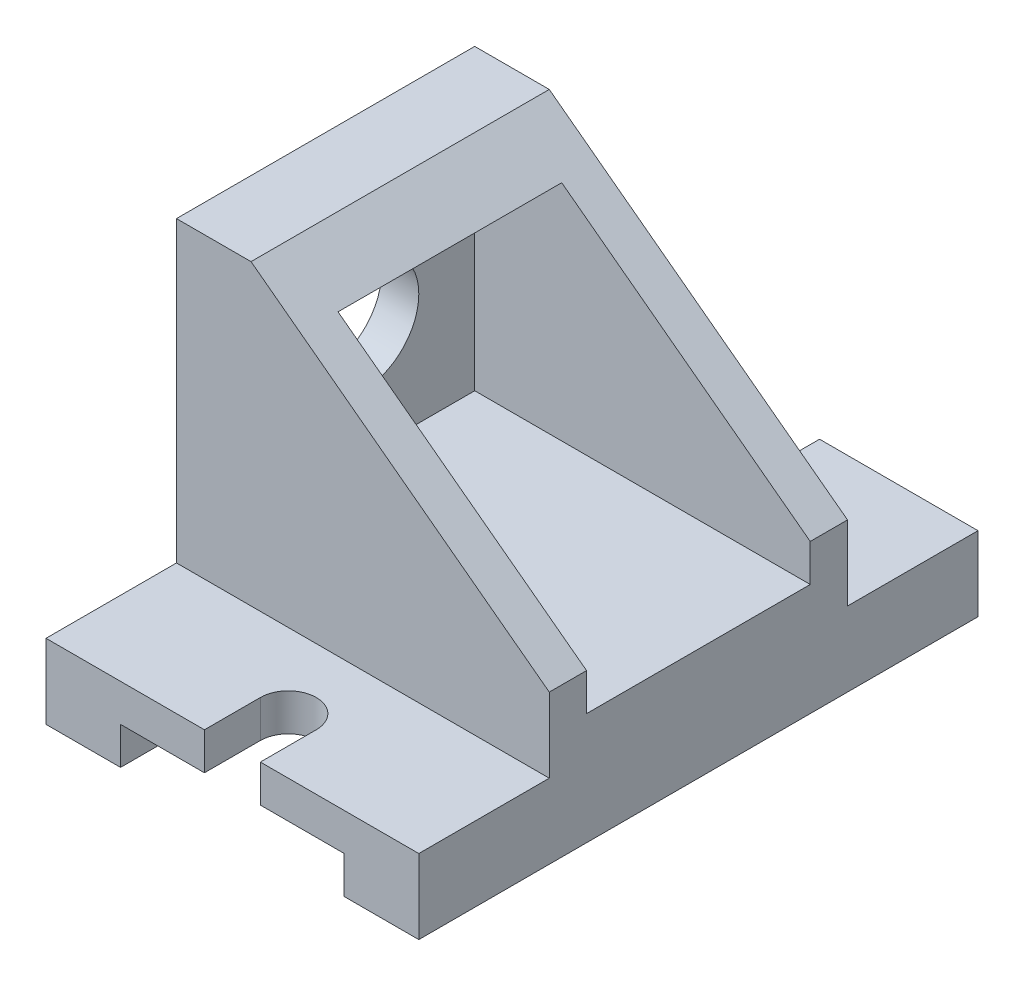
ISO-10303-21;
HEADER;
FILE_DESCRIPTION(('STEP AP214'),'2;1');
FILE_NAME('part.step','',(''),(''),'','','');
FILE_SCHEMA(('AUTOMOTIVE_DESIGN { 1 0 10303 214 1 1 1 1 }'));
ENDSEC;
DATA;
#1=APPLICATION_CONTEXT('core data for automotive mechanical design processes');
#2=APPLICATION_PROTOCOL_DEFINITION('international standard','automotive_design',2000,#1);
#3=PRODUCT_CONTEXT('',#1,'mechanical');
#4=PRODUCT('Part','Part','',(#3));
#5=PRODUCT_RELATED_PRODUCT_CATEGORY('part','',(#4));
#6=PRODUCT_DEFINITION_FORMATION('','',#4);
#7=PRODUCT_DEFINITION_CONTEXT('part definition',#1,'design');
#8=PRODUCT_DEFINITION('design','',#6,#7);
#9=PRODUCT_DEFINITION_SHAPE('','',#8);
#10=(LENGTH_UNIT() NAMED_UNIT(*) SI_UNIT(.MILLI.,.METRE.));
#11=(NAMED_UNIT(*) PLANE_ANGLE_UNIT() SI_UNIT($,.RADIAN.));
#12=(NAMED_UNIT(*) SI_UNIT($,.STERADIAN.) SOLID_ANGLE_UNIT());
#13=UNCERTAINTY_MEASURE_WITH_UNIT(LENGTH_MEASURE(1.E-05),#10,'distance_accuracy_value','');
#14=(GEOMETRIC_REPRESENTATION_CONTEXT(3) GLOBAL_UNCERTAINTY_ASSIGNED_CONTEXT((#13)) GLOBAL_UNIT_ASSIGNED_CONTEXT((#10,
#11,#12)) REPRESENTATION_CONTEXT('',''));
#15=CARTESIAN_POINT('',(0.,0.,0.));
#16=DIRECTION('',(0.,0.,1.));
#17=DIRECTION('',(1.,0.,0.));
#18=AXIS2_PLACEMENT_3D('',#15,#16,#17);
#19=CARTESIAN_POINT('',(0.,0.,-150.));
#20=DIRECTION('',(0.,-1.,0.));
#21=DIRECTION('',(0.,0.,-1.));
#22=AXIS2_PLACEMENT_3D('',#19,#20,#21);
#23=PLANE('',#22);
#24=DIRECTION('',(0.,0.,1.));
#25=VECTOR('',#24,1.);
#26=CARTESIAN_POINT('',(80.,0.,-178.));
#27=LINE('',#26,#25);
#28=CARTESIAN_POINT('',(80.,0.,-150.));
#29=VERTEX_POINT('',#28);
#30=CARTESIAN_POINT('',(80.,0.,0.));
#31=VERTEX_POINT('',#30);
#32=EDGE_CURVE('E292',#29,#31,#27,.T.);
#33=ORIENTED_EDGE('',*,*,#32,.F.);
#34=DIRECTION('',(1.,0.,0.));
#35=VECTOR('',#34,1.);
#36=CARTESIAN_POINT('',(0.,0.,-150.));
#37=LINE('',#36,#35);
#38=CARTESIAN_POINT('',(100.,0.,-150.));
#39=VERTEX_POINT('',#38);
#40=EDGE_CURVE('E434',#29,#39,#37,.T.);
#41=ORIENTED_EDGE('',*,*,#40,.T.);
#42=DIRECTION('',(0.,0.,1.));
#43=VECTOR('',#42,1.);
#44=CARTESIAN_POINT('',(100.,0.,-150.));
#45=LINE('',#44,#43);
#46=CARTESIAN_POINT('',(100.,0.,0.));
#47=VERTEX_POINT('',#46);
#48=EDGE_CURVE('E460',#39,#47,#45,.T.);
#49=ORIENTED_EDGE('',*,*,#48,.T.);
#50=DIRECTION('',(1.,0.,0.));
#51=VECTOR('',#50,1.);
#52=CARTESIAN_POINT('',(0.,0.,0.));
#53=LINE('',#52,#51);
#54=EDGE_CURVE('E447',#31,#47,#53,.T.);
#55=ORIENTED_EDGE('',*,*,#54,.F.);
#56=EDGE_LOOP('',(#33,#41,#49,#55));
#57=FACE_BOUND('',#56,.T.);
#58=ADVANCED_FACE('F43',(#57),#23,.T.);
#59=CARTESIAN_POINT('',(0.,0.,-150.));
#60=DIRECTION('',(0.,0.,-1.));
#61=DIRECTION('',(-1.,0.,0.));
#62=AXIS2_PLACEMENT_3D('',#59,#60,#61);
#63=PLANE('',#62);
#64=DIRECTION('',(0.,1.,0.));
#65=VECTOR('',#64,1.);
#66=CARTESIAN_POINT('',(20.,0.,-150.));
#67=LINE('',#66,#65);
#68=CARTESIAN_POINT('',(20.,0.,-150.));
#69=VERTEX_POINT('',#68);
#70=CARTESIAN_POINT('',(20.,9.99999999999999,-150.));
#71=VERTEX_POINT('',#70);
#72=EDGE_CURVE('E327',#69,#71,#67,.T.);
#73=ORIENTED_EDGE('',*,*,#72,.F.);
#74=CARTESIAN_POINT('',(0.,0.,-150.));
#75=VERTEX_POINT('',#74);
#76=EDGE_CURVE('E436',#75,#69,#37,.T.);
#77=ORIENTED_EDGE('',*,*,#76,.F.);
#78=DIRECTION('',(0.,-1.,0.));
#79=VECTOR('',#78,1.);
#80=CARTESIAN_POINT('',(0.,0.,-150.));
#81=LINE('',#80,#79);
#82=CARTESIAN_POINT('',(0.,20.,-150.));
#83=VERTEX_POINT('',#82);
#84=EDGE_CURVE('E431',#83,#75,#81,.T.);
#85=ORIENTED_EDGE('',*,*,#84,.F.);
#86=DIRECTION('',(-1.,0.,0.));
#87=VECTOR('',#86,1.);
#88=CARTESIAN_POINT('',(0.,20.,-150.));
#89=LINE('',#88,#87);
#90=CARTESIAN_POINT('',(42.5,20.,-150.));
#91=VERTEX_POINT('',#90);
#92=EDGE_CURVE('E403',#91,#83,#89,.T.);
#93=ORIENTED_EDGE('',*,*,#92,.F.);
#94=DIRECTION('',(0.,1.,0.));
#95=VECTOR('',#94,1.);
#96=CARTESIAN_POINT('',(42.5,-3.,-150.));
#97=LINE('',#96,#95);
#98=CARTESIAN_POINT('',(42.5,10.,-150.));
#99=VERTEX_POINT('',#98);
#100=EDGE_CURVE('E344',#99,#91,#97,.T.);
#101=ORIENTED_EDGE('',*,*,#100,.F.);
#102=DIRECTION('',(1.,0.,0.));
#103=VECTOR('',#102,1.);
#104=CARTESIAN_POINT('',(0.,9.99999999999999,-150.));
#105=LINE('',#104,#103);
#106=EDGE_CURVE('E324',#71,#99,#105,.T.);
#107=ORIENTED_EDGE('',*,*,#106,.F.);
#108=EDGE_LOOP('',(#73,#77,#85,#93,#101,#107));
#109=FACE_BOUND('',#108,.T.);
#110=ADVANCED_FACE('F575',(#109),#63,.T.);
#111=CARTESIAN_POINT('',(0.,0.,0.));
#112=DIRECTION('',(0.,0.,-1.));
#113=DIRECTION('',(-1.,0.,0.));
#114=AXIS2_PLACEMENT_3D('',#111,#112,#113);
#115=PLANE('',#114);
#116=DIRECTION('',(-1.,0.,0.));
#117=VECTOR('',#116,1.);
#118=CARTESIAN_POINT('',(80.,10.,0.));
#119=LINE('',#118,#117);
#120=CARTESIAN_POINT('',(80.,10.,0.));
#121=VERTEX_POINT('',#120);
#122=CARTESIAN_POINT('',(57.5,10.,0.));
#123=VERTEX_POINT('',#122);
#124=EDGE_CURVE('E285',#121,#123,#119,.T.);
#125=ORIENTED_EDGE('',*,*,#124,.F.);
#126=DIRECTION('',(0.,1.,0.));
#127=VECTOR('',#126,1.);
#128=CARTESIAN_POINT('',(80.,10.,0.));
#129=LINE('',#128,#127);
#130=EDGE_CURVE('E277',#31,#121,#129,.T.);
#131=ORIENTED_EDGE('',*,*,#130,.F.);
#132=ORIENTED_EDGE('',*,*,#54,.T.);
#133=DIRECTION('',(0.,1.,0.));
#134=VECTOR('',#133,1.);
#135=CARTESIAN_POINT('',(100.,0.,0.));
#136=LINE('',#135,#134);
#137=CARTESIAN_POINT('',(100.,20.,0.));
#138=VERTEX_POINT('',#137);
#139=EDGE_CURVE('E435',#47,#138,#136,.T.);
#140=ORIENTED_EDGE('',*,*,#139,.T.);
#141=DIRECTION('',(1.,0.,0.));
#142=VECTOR('',#141,1.);
#143=CARTESIAN_POINT('',(0.,20.,0.));
#144=LINE('',#143,#142);
#145=CARTESIAN_POINT('',(57.5,20.,0.));
#146=VERTEX_POINT('',#145);
#147=EDGE_CURVE('E368',#146,#138,#144,.T.);
#148=ORIENTED_EDGE('',*,*,#147,.F.);
#149=DIRECTION('',(0.,1.,0.));
#150=VECTOR('',#149,1.);
#151=CARTESIAN_POINT('',(57.5,-3.,0.));
#152=LINE('',#151,#150);
#153=EDGE_CURVE('E335',#123,#146,#152,.T.);
#154=ORIENTED_EDGE('',*,*,#153,.F.);
#155=EDGE_LOOP('',(#125,#131,#132,#140,#148,#154));
#156=FACE_BOUND('',#155,.T.);
#157=ADVANCED_FACE('F555',(#156),#115,.F.);
#158=DIRECTION('',(0.,0.,1.));
#159=VECTOR('',#158,1.);
#160=CARTESIAN_POINT('',(20.,0.,-178.));
#161=LINE('',#160,#159);
#162=CARTESIAN_POINT('',(20.,0.,0.));
#163=VERTEX_POINT('',#162);
#164=EDGE_CURVE('E296',#69,#163,#161,.T.);
#165=ORIENTED_EDGE('',*,*,#164,.T.);
#166=CARTESIAN_POINT('',(0.,0.,0.));
#167=VERTEX_POINT('',#166);
#168=EDGE_CURVE('E448',#167,#163,#53,.T.);
#169=ORIENTED_EDGE('',*,*,#168,.F.);
#170=DIRECTION('',(0.,0.,1.));
#171=VECTOR('',#170,1.);
#172=CARTESIAN_POINT('',(0.,0.,-150.));
#173=LINE('',#172,#171);
#174=EDGE_CURVE('E444',#75,#167,#173,.T.);
#175=ORIENTED_EDGE('',*,*,#174,.F.);
#176=ORIENTED_EDGE('',*,*,#76,.T.);
#177=EDGE_LOOP('',(#165,#169,#175,#176));
#178=FACE_BOUND('',#177,.T.);
#179=ADVANCED_FACE('F581',(#178),#23,.T.);
#180=CARTESIAN_POINT('',(0.,0.,-150.));
#181=DIRECTION('',(-1.,0.,0.));
#182=DIRECTION('',(0.,0.,1.));
#183=AXIS2_PLACEMENT_3D('',#180,#181,#182);
#184=PLANE('',#183);
#185=CARTESIAN_POINT('',(0.,60.,-75.));
#186=DIRECTION('',(-1.,0.,0.));
#187=DIRECTION('',(0.,0.,1.));
#188=AXIS2_PLACEMENT_3D('',#185,#186,#187);
#189=CIRCLE('',#188,15.);
#190=CARTESIAN_POINT('',(0.,60.,-60.));
#191=VERTEX_POINT('',#190);
#192=EDGE_CURVE('E250',#191,#191,#189,.T.);
#193=ORIENTED_EDGE('',*,*,#192,.F.);
#194=EDGE_LOOP('',(#193));
#195=FACE_BOUND('',#194,.T.);
#196=DIRECTION('',(0.,0.,1.));
#197=VECTOR('',#196,1.);
#198=CARTESIAN_POINT('',(0.,20.,0.));
#199=LINE('',#198,#197);
#200=CARTESIAN_POINT('',(0.,20.,-35.));
#201=VERTEX_POINT('',#200);
#202=CARTESIAN_POINT('',(0.,20.,0.));
#203=VERTEX_POINT('',#202);
#204=EDGE_CURVE('E379',#201,#203,#199,.T.);
#205=ORIENTED_EDGE('',*,*,#204,.F.);
#206=DIRECTION('',(0.,1.,0.));
#207=VECTOR('',#206,1.);
#208=CARTESIAN_POINT('',(0.,20.,-35.));
#209=LINE('',#208,#207);
#210=CARTESIAN_POINT('',(0.,100.,-35.));
#211=VERTEX_POINT('',#210);
#212=EDGE_CURVE('E386',#201,#211,#209,.T.);
#213=ORIENTED_EDGE('',*,*,#212,.T.);
#214=DIRECTION('',(0.,0.,1.));
#215=VECTOR('',#214,1.);
#216=CARTESIAN_POINT('',(0.,100.,-150.));
#217=LINE('',#216,#215);
#218=CARTESIAN_POINT('',(0.,100.,-115.));
#219=VERTEX_POINT('',#218);
#220=EDGE_CURVE('E455',#219,#211,#217,.T.);
#221=ORIENTED_EDGE('',*,*,#220,.F.);
#222=DIRECTION('',(0.,1.,0.));
#223=VECTOR('',#222,1.);
#224=CARTESIAN_POINT('',(0.,20.,-115.));
#225=LINE('',#224,#223);
#226=CARTESIAN_POINT('',(0.,20.,-115.));
#227=VERTEX_POINT('',#226);
#228=EDGE_CURVE('E422',#227,#219,#225,.T.);
#229=ORIENTED_EDGE('',*,*,#228,.F.);
#230=DIRECTION('',(0.,0.,1.));
#231=VECTOR('',#230,1.);
#232=CARTESIAN_POINT('',(0.,20.,0.));
#233=LINE('',#232,#231);
#234=EDGE_CURVE('E406',#83,#227,#233,.T.);
#235=ORIENTED_EDGE('',*,*,#234,.F.);
#236=ORIENTED_EDGE('',*,*,#84,.T.);
#237=ORIENTED_EDGE('',*,*,#174,.T.);
#238=DIRECTION('',(0.,-1.,0.));
#239=VECTOR('',#238,1.);
#240=CARTESIAN_POINT('',(0.,0.,0.));
#241=LINE('',#240,#239);
#242=EDGE_CURVE('E390',#203,#167,#241,.T.);
#243=ORIENTED_EDGE('',*,*,#242,.F.);
#244=EDGE_LOOP('',(#205,#213,#221,#229,#235,#236,#237,#243));
#245=FACE_BOUND('',#244,.T.);
#246=ADVANCED_FACE('F45',(#195,#245),#184,.T.);
#247=CARTESIAN_POINT('',(0.,100.,-150.));
#248=DIRECTION('',(0.,1.,0.));
#249=DIRECTION('',(0.,0.,1.));
#250=AXIS2_PLACEMENT_3D('',#247,#248,#249);
#251=PLANE('',#250);
#252=DIRECTION('',(0.,0.,1.));
#253=VECTOR('',#252,1.);
#254=CARTESIAN_POINT('',(20.,100.,-116.));
#255=LINE('',#254,#253);
#256=CARTESIAN_POINT('',(20.,100.,-115.));
#257=VERTEX_POINT('',#256);
#258=CARTESIAN_POINT('',(20.,100.,-35.));
#259=VERTEX_POINT('',#258);
#260=EDGE_CURVE('E274',#257,#259,#255,.T.);
#261=ORIENTED_EDGE('',*,*,#260,.F.);
#262=DIRECTION('',(1.,0.,0.));
#263=VECTOR('',#262,1.);
#264=CARTESIAN_POINT('',(0.,100.,-115.));
#265=LINE('',#264,#263);
#266=EDGE_CURVE('E334',#219,#257,#265,.T.);
#267=ORIENTED_EDGE('',*,*,#266,.F.);
#268=ORIENTED_EDGE('',*,*,#220,.T.);
#269=DIRECTION('',(1.,0.,0.));
#270=VECTOR('',#269,1.);
#271=CARTESIAN_POINT('',(0.,100.,-35.));
#272=LINE('',#271,#270);
#273=EDGE_CURVE('E360',#211,#259,#272,.T.);
#274=ORIENTED_EDGE('',*,*,#273,.T.);
#275=EDGE_LOOP('',(#261,#267,#268,#274));
#276=FACE_BOUND('',#275,.T.);
#277=ADVANCED_FACE('F521',(#276),#251,.T.);
#278=CARTESIAN_POINT('',(100.,0.,-150.));
#279=DIRECTION('',(1.,0.,0.));
#280=DIRECTION('',(0.,0.,-1.));
#281=AXIS2_PLACEMENT_3D('',#278,#279,#280);
#282=PLANE('',#281);
#283=DIRECTION('',(0.,-1.,0.));
#284=VECTOR('',#283,1.);
#285=CARTESIAN_POINT('',(100.,90.,-45.));
#286=LINE('',#285,#284);
#287=CARTESIAN_POINT('',(100.,40.,-45.));
#288=VERTEX_POINT('',#287);
#289=CARTESIAN_POINT('',(100.,30.,-45.));
#290=VERTEX_POINT('',#289);
#291=EDGE_CURVE('E225',#288,#290,#286,.T.);
#292=ORIENTED_EDGE('',*,*,#291,.F.);
#293=DIRECTION('',(0.,0.,1.));
#294=VECTOR('',#293,1.);
#295=CARTESIAN_POINT('',(100.,40.,-116.));
#296=LINE('',#295,#294);
#297=CARTESIAN_POINT('',(100.,40.,-35.));
#298=VERTEX_POINT('',#297);
#299=EDGE_CURVE('E278',#288,#298,#296,.T.);
#300=ORIENTED_EDGE('',*,*,#299,.T.);
#301=DIRECTION('',(0.,1.,0.));
#302=VECTOR('',#301,1.);
#303=CARTESIAN_POINT('',(100.,20.,-35.));
#304=LINE('',#303,#302);
#305=CARTESIAN_POINT('',(100.,20.,-35.));
#306=VERTEX_POINT('',#305);
#307=EDGE_CURVE('E391',#306,#298,#304,.T.);
#308=ORIENTED_EDGE('',*,*,#307,.F.);
#309=DIRECTION('',(0.,0.,-1.));
#310=VECTOR('',#309,1.);
#311=CARTESIAN_POINT('',(100.,20.,0.));
#312=LINE('',#311,#310);
#313=EDGE_CURVE('E371',#138,#306,#312,.T.);
#314=ORIENTED_EDGE('',*,*,#313,.F.);
#315=ORIENTED_EDGE('',*,*,#139,.F.);
#316=ORIENTED_EDGE('',*,*,#48,.F.);
#317=DIRECTION('',(0.,1.,0.));
#318=VECTOR('',#317,1.);
#319=CARTESIAN_POINT('',(100.,0.,-150.));
#320=LINE('',#319,#318);
#321=CARTESIAN_POINT('',(100.,20.,-150.));
#322=VERTEX_POINT('',#321);
#323=EDGE_CURVE('E440',#39,#322,#320,.T.);
#324=ORIENTED_EDGE('',*,*,#323,.T.);
#325=DIRECTION('',(0.,0.,-1.));
#326=VECTOR('',#325,1.);
#327=CARTESIAN_POINT('',(100.,20.,0.));
#328=LINE('',#327,#326);
#329=CARTESIAN_POINT('',(100.,20.,-115.));
#330=VERTEX_POINT('',#329);
#331=EDGE_CURVE('E415',#330,#322,#328,.T.);
#332=ORIENTED_EDGE('',*,*,#331,.F.);
#333=DIRECTION('',(0.,1.,0.));
#334=VECTOR('',#333,1.);
#335=CARTESIAN_POINT('',(100.,20.,-115.));
#336=LINE('',#335,#334);
#337=CARTESIAN_POINT('',(100.,40.,-115.));
#338=VERTEX_POINT('',#337);
#339=EDGE_CURVE('E385',#330,#338,#336,.T.);
#340=ORIENTED_EDGE('',*,*,#339,.T.);
#341=CARTESIAN_POINT('',(100.,40.,-105.));
#342=VERTEX_POINT('',#341);
#343=EDGE_CURVE('E66',#338,#342,#296,.T.);
#344=ORIENTED_EDGE('',*,*,#343,.T.);
#345=DIRECTION('',(0.,1.,0.));
#346=VECTOR('',#345,1.);
#347=CARTESIAN_POINT('',(100.,90.,-105.));
#348=LINE('',#347,#346);
#349=CARTESIAN_POINT('',(100.,30.,-105.));
#350=VERTEX_POINT('',#349);
#351=EDGE_CURVE('E59',#350,#342,#348,.T.);
#352=ORIENTED_EDGE('',*,*,#351,.F.);
#353=DIRECTION('',(0.,0.,-1.));
#354=VECTOR('',#353,1.);
#355=CARTESIAN_POINT('',(100.,30.,-45.));
#356=LINE('',#355,#354);
#357=EDGE_CURVE('E247',#290,#350,#356,.T.);
#358=ORIENTED_EDGE('',*,*,#357,.F.);
#359=EDGE_LOOP('',(#292,#300,#308,#314,#315,#316,#324,#332,#340,#344,#352,#358));
#360=FACE_BOUND('',#359,.T.);
#361=ADVANCED_FACE('F485',(#360),#282,.T.);
#362=DIRECTION('',(0.,-1.,0.));
#363=VECTOR('',#362,1.);
#364=CARTESIAN_POINT('',(80.,0.,-150.));
#365=LINE('',#364,#363);
#366=CARTESIAN_POINT('',(80.,10.,-150.));
#367=VERTEX_POINT('',#366);
#368=EDGE_CURVE('E470',#367,#29,#365,.T.);
#369=ORIENTED_EDGE('',*,*,#368,.F.);
#370=DIRECTION('',(1.,0.,0.));
#371=VECTOR('',#370,1.);
#372=CARTESIAN_POINT('',(0.,9.99999999999999,-150.));
#373=LINE('',#372,#371);
#374=CARTESIAN_POINT('',(57.5,10.,-150.));
#375=VERTEX_POINT('',#374);
#376=EDGE_CURVE('E321',#375,#367,#373,.T.);
#377=ORIENTED_EDGE('',*,*,#376,.F.);
#378=DIRECTION('',(0.,1.,0.));
#379=VECTOR('',#378,1.);
#380=CARTESIAN_POINT('',(57.5,-3.,-150.));
#381=LINE('',#380,#379);
#382=CARTESIAN_POINT('',(57.5,20.,-150.));
#383=VERTEX_POINT('',#382);
#384=EDGE_CURVE('E347',#375,#383,#381,.T.);
#385=ORIENTED_EDGE('',*,*,#384,.T.);
#386=EDGE_CURVE('E407',#322,#383,#89,.T.);
#387=ORIENTED_EDGE('',*,*,#386,.F.);
#388=ORIENTED_EDGE('',*,*,#323,.F.);
#389=ORIENTED_EDGE('',*,*,#40,.F.);
#390=EDGE_LOOP('',(#369,#377,#385,#387,#388,#389));
#391=FACE_BOUND('',#390,.T.);
#392=ADVANCED_FACE('F509',(#391),#63,.T.);
#393=ORIENTED_EDGE('',*,*,#168,.T.);
#394=DIRECTION('',(0.,-1.,0.));
#395=VECTOR('',#394,1.);
#396=CARTESIAN_POINT('',(20.,9.99999999999999,0.));
#397=LINE('',#396,#395);
#398=CARTESIAN_POINT('',(20.,9.99999999999999,0.));
#399=VERTEX_POINT('',#398);
#400=EDGE_CURVE('E288',#399,#163,#397,.T.);
#401=ORIENTED_EDGE('',*,*,#400,.F.);
#402=CARTESIAN_POINT('',(42.5,10.,0.));
#403=VERTEX_POINT('',#402);
#404=EDGE_CURVE('E284',#403,#399,#119,.T.);
#405=ORIENTED_EDGE('',*,*,#404,.F.);
#406=DIRECTION('',(0.,1.,0.));
#407=VECTOR('',#406,1.);
#408=CARTESIAN_POINT('',(42.5,-3.,0.));
#409=LINE('',#408,#407);
#410=CARTESIAN_POINT('',(42.5,20.,0.));
#411=VERTEX_POINT('',#410);
#412=EDGE_CURVE('E338',#403,#411,#409,.T.);
#413=ORIENTED_EDGE('',*,*,#412,.T.);
#414=EDGE_CURVE('E372',#203,#411,#144,.T.);
#415=ORIENTED_EDGE('',*,*,#414,.F.);
#416=ORIENTED_EDGE('',*,*,#242,.T.);
#417=EDGE_LOOP('',(#393,#401,#405,#413,#415,#416));
#418=FACE_BOUND('',#417,.T.);
#419=ADVANCED_FACE('F535',(#418),#115,.F.);
#420=CARTESIAN_POINT('',(0.,20.,-35.));
#421=DIRECTION('',(0.,0.,1.));
#422=DIRECTION('',(1.,0.,0.));
#423=AXIS2_PLACEMENT_3D('',#420,#421,#422);
#424=PLANE('',#423);
#425=DIRECTION('',(0.8,-0.6,0.));
#426=VECTOR('',#425,1.);
#427=CARTESIAN_POINT('',(55.2,73.6,-35.));
#428=LINE('',#427,#426);
#429=EDGE_CURVE('E264',#259,#298,#428,.T.);
#430=ORIENTED_EDGE('',*,*,#429,.F.);
#431=ORIENTED_EDGE('',*,*,#273,.F.);
#432=ORIENTED_EDGE('',*,*,#212,.F.);
#433=DIRECTION('',(1.,0.,0.));
#434=VECTOR('',#433,1.);
#435=CARTESIAN_POINT('',(0.,20.,-35.));
#436=LINE('',#435,#434);
#437=EDGE_CURVE('E376',#201,#306,#436,.T.);
#438=ORIENTED_EDGE('',*,*,#437,.T.);
#439=ORIENTED_EDGE('',*,*,#307,.T.);
#440=EDGE_LOOP('',(#430,#431,#432,#438,#439));
#441=FACE_BOUND('',#440,.T.);
#442=ADVANCED_FACE('F524',(#441),#424,.T.);
#443=CARTESIAN_POINT('',(0.,20.,0.));
#444=DIRECTION('',(0.,1.,0.));
#445=DIRECTION('',(0.,0.,1.));
#446=AXIS2_PLACEMENT_3D('',#443,#444,#445);
#447=PLANE('',#446);
#448=DIRECTION('',(0.,0.,1.));
#449=VECTOR('',#448,1.);
#450=CARTESIAN_POINT('',(42.5,20.,0.));
#451=LINE('',#450,#449);
#452=CARTESIAN_POINT('',(42.5,20.,-15.));
#453=VERTEX_POINT('',#452);
#454=EDGE_CURVE('E355',#453,#411,#451,.T.);
#455=ORIENTED_EDGE('',*,*,#454,.F.);
#456=CARTESIAN_POINT('',(50.,20.,-15.));
#457=DIRECTION('',(0.,1.,0.));
#458=DIRECTION('',(0.,0.,1.));
#459=AXIS2_PLACEMENT_3D('',#456,#457,#458);
#460=CIRCLE('',#459,7.5);
#461=CARTESIAN_POINT('',(57.5,20.,-15.));
#462=VERTEX_POINT('',#461);
#463=EDGE_CURVE('E359',#453,#462,#460,.F.);
#464=ORIENTED_EDGE('',*,*,#463,.T.);
#465=DIRECTION('',(0.,0.,1.));
#466=VECTOR('',#465,1.);
#467=CARTESIAN_POINT('',(57.5,20.,0.));
#468=LINE('',#467,#466);
#469=EDGE_CURVE('E364',#462,#146,#468,.T.);
#470=ORIENTED_EDGE('',*,*,#469,.T.);
#471=ORIENTED_EDGE('',*,*,#147,.T.);
#472=ORIENTED_EDGE('',*,*,#313,.T.);
#473=ORIENTED_EDGE('',*,*,#437,.F.);
#474=ORIENTED_EDGE('',*,*,#204,.T.);
#475=ORIENTED_EDGE('',*,*,#414,.T.);
#476=EDGE_LOOP('',(#455,#464,#470,#471,#472,#473,#474,#475));
#477=FACE_BOUND('',#476,.T.);
#478=ADVANCED_FACE('F533',(#477),#447,.T.);
#479=CARTESIAN_POINT('',(0.,20.,-115.));
#480=DIRECTION('',(0.,0.,1.));
#481=DIRECTION('',(1.,0.,0.));
#482=AXIS2_PLACEMENT_3D('',#479,#480,#481);
#483=PLANE('',#482);
#484=ORIENTED_EDGE('',*,*,#266,.T.);
#485=DIRECTION('',(0.8,-0.6,0.));
#486=VECTOR('',#485,1.);
#487=CARTESIAN_POINT('',(45.6,80.8,-115.));
#488=LINE('',#487,#486);
#489=EDGE_CURVE('E473',#257,#338,#488,.T.);
#490=ORIENTED_EDGE('',*,*,#489,.T.);
#491=ORIENTED_EDGE('',*,*,#339,.F.);
#492=DIRECTION('',(1.,0.,0.));
#493=VECTOR('',#492,1.);
#494=CARTESIAN_POINT('',(0.,20.,-115.));
#495=LINE('',#494,#493);
#496=EDGE_CURVE('E411',#227,#330,#495,.T.);
#497=ORIENTED_EDGE('',*,*,#496,.F.);
#498=ORIENTED_EDGE('',*,*,#228,.T.);
#499=EDGE_LOOP('',(#484,#490,#491,#497,#498));
#500=FACE_BOUND('',#499,.T.);
#501=ADVANCED_FACE('F517',(#500),#483,.F.);
#502=CARTESIAN_POINT('',(0.,20.,0.));
#503=DIRECTION('',(0.,1.,0.));
#504=DIRECTION('',(0.,0.,1.));
#505=AXIS2_PLACEMENT_3D('',#502,#503,#504);
#506=PLANE('',#505);
#507=CARTESIAN_POINT('',(50.,20.,-135.));
#508=DIRECTION('',(0.,1.,0.));
#509=DIRECTION('',(0.,0.,1.));
#510=AXIS2_PLACEMENT_3D('',#507,#508,#509);
#511=CIRCLE('',#510,7.5);
#512=CARTESIAN_POINT('',(42.5,20.,-135.));
#513=VERTEX_POINT('',#512);
#514=CARTESIAN_POINT('',(57.5,20.,-135.));
#515=VERTEX_POINT('',#514);
#516=EDGE_CURVE('E395',#513,#515,#511,.T.);
#517=ORIENTED_EDGE('',*,*,#516,.F.);
#518=DIRECTION('',(0.,0.,-1.));
#519=VECTOR('',#518,1.);
#520=CARTESIAN_POINT('',(42.5,20.,0.));
#521=LINE('',#520,#519);
#522=EDGE_CURVE('E399',#513,#91,#521,.T.);
#523=ORIENTED_EDGE('',*,*,#522,.T.);
#524=ORIENTED_EDGE('',*,*,#92,.T.);
#525=ORIENTED_EDGE('',*,*,#234,.T.);
#526=ORIENTED_EDGE('',*,*,#496,.T.);
#527=ORIENTED_EDGE('',*,*,#331,.T.);
#528=ORIENTED_EDGE('',*,*,#386,.T.);
#529=DIRECTION('',(0.,0.,-1.));
#530=VECTOR('',#529,1.);
#531=CARTESIAN_POINT('',(57.5,20.,0.));
#532=LINE('',#531,#530);
#533=EDGE_CURVE('E418',#515,#383,#532,.T.);
#534=ORIENTED_EDGE('',*,*,#533,.F.);
#535=EDGE_LOOP('',(#517,#523,#524,#525,#526,#527,#528,#534));
#536=FACE_BOUND('',#535,.T.);
#537=ADVANCED_FACE('F515',(#536),#506,.T.);
#538=CARTESIAN_POINT('',(42.5,-3.,0.));
#539=DIRECTION('',(1.,0.,0.));
#540=DIRECTION('',(0.,0.,-1.));
#541=AXIS2_PLACEMENT_3D('',#538,#539,#540);
#542=PLANE('',#541);
#543=DIRECTION('',(0.,0.,1.));
#544=VECTOR('',#543,1.);
#545=CARTESIAN_POINT('',(42.5,10.,0.));
#546=LINE('',#545,#544);
#547=CARTESIAN_POINT('',(42.5,10.,-135.));
#548=VERTEX_POINT('',#547);
#549=EDGE_CURVE('E318',#99,#548,#546,.T.);
#550=ORIENTED_EDGE('',*,*,#549,.F.);
#551=ORIENTED_EDGE('',*,*,#100,.T.);
#552=ORIENTED_EDGE('',*,*,#522,.F.);
#553=DIRECTION('',(0.,1.,0.));
#554=VECTOR('',#553,1.);
#555=CARTESIAN_POINT('',(42.5,-3.,-135.));
#556=LINE('',#555,#554);
#557=EDGE_CURVE('E330',#548,#513,#556,.T.);
#558=ORIENTED_EDGE('',*,*,#557,.F.);
#559=EDGE_LOOP('',(#550,#551,#552,#558));
#560=FACE_BOUND('',#559,.T.);
#561=ADVANCED_FACE('F625',(#560),#542,.T.);
#562=CARTESIAN_POINT('',(57.5,-3.,0.));
#563=DIRECTION('',(1.,0.,0.));
#564=DIRECTION('',(0.,0.,-1.));
#565=AXIS2_PLACEMENT_3D('',#562,#563,#564);
#566=PLANE('',#565);
#567=ORIENTED_EDGE('',*,*,#384,.F.);
#568=DIRECTION('',(0.,0.,1.));
#569=VECTOR('',#568,1.);
#570=CARTESIAN_POINT('',(57.5,10.,0.));
#571=LINE('',#570,#569);
#572=CARTESIAN_POINT('',(57.5,10.,-135.));
#573=VERTEX_POINT('',#572);
#574=EDGE_CURVE('E314',#375,#573,#571,.T.);
#575=ORIENTED_EDGE('',*,*,#574,.T.);
#576=DIRECTION('',(0.,1.,0.));
#577=VECTOR('',#576,1.);
#578=CARTESIAN_POINT('',(57.5,-3.,-135.));
#579=LINE('',#578,#577);
#580=EDGE_CURVE('E350',#573,#515,#579,.T.);
#581=ORIENTED_EDGE('',*,*,#580,.T.);
#582=ORIENTED_EDGE('',*,*,#533,.T.);
#583=EDGE_LOOP('',(#567,#575,#581,#582));
#584=FACE_BOUND('',#583,.T.);
#585=ADVANCED_FACE('F562',(#584),#566,.F.);
#586=CARTESIAN_POINT('',(50.,-3.,-135.));
#587=DIRECTION('',(0.,1.,0.));
#588=DIRECTION('',(0.,0.,1.));
#589=AXIS2_PLACEMENT_3D('',#586,#587,#588);
#590=CYLINDRICAL_SURFACE('',#589,7.5);
#591=ORIENTED_EDGE('',*,*,#580,.F.);
#592=CARTESIAN_POINT('',(50.,10.,-135.));
#593=DIRECTION('',(0.,1.,0.));
#594=DIRECTION('',(-1.,0.,0.));
#595=AXIS2_PLACEMENT_3D('',#592,#593,#594);
#596=CIRCLE('',#595,7.5);
#597=EDGE_CURVE('E310',#573,#548,#596,.F.);
#598=ORIENTED_EDGE('',*,*,#597,.T.);
#599=ORIENTED_EDGE('',*,*,#557,.T.);
#600=ORIENTED_EDGE('',*,*,#516,.T.);
#601=EDGE_LOOP('',(#591,#598,#599,#600));
#602=FACE_BOUND('',#601,.T.);
#603=ADVANCED_FACE('F565',(#602),#590,.F.);
#604=CARTESIAN_POINT('',(50.,-3.,-15.));
#605=DIRECTION('',(0.,1.,0.));
#606=DIRECTION('',(0.,0.,1.));
#607=AXIS2_PLACEMENT_3D('',#604,#605,#606);
#608=CYLINDRICAL_SURFACE('',#607,7.5);
#609=CARTESIAN_POINT('',(50.,10.,-15.));
#610=DIRECTION('',(0.,1.,0.));
#611=DIRECTION('',(-1.,0.,0.));
#612=AXIS2_PLACEMENT_3D('',#609,#610,#611);
#613=CIRCLE('',#612,7.5);
#614=CARTESIAN_POINT('',(57.5,10.,-15.));
#615=VERTEX_POINT('',#614);
#616=CARTESIAN_POINT('',(42.5,10.,-15.));
#617=VERTEX_POINT('',#616);
#618=EDGE_CURVE('E295',#615,#617,#613,.T.);
#619=ORIENTED_EDGE('',*,*,#618,.F.);
#620=DIRECTION('',(0.,1.,0.));
#621=VECTOR('',#620,1.);
#622=CARTESIAN_POINT('',(57.5,-3.,-15.));
#623=LINE('',#622,#621);
#624=EDGE_CURVE('E331',#615,#462,#623,.T.);
#625=ORIENTED_EDGE('',*,*,#624,.T.);
#626=ORIENTED_EDGE('',*,*,#463,.F.);
#627=DIRECTION('',(0.,1.,0.));
#628=VECTOR('',#627,1.);
#629=CARTESIAN_POINT('',(42.5,-3.,-15.));
#630=LINE('',#629,#628);
#631=EDGE_CURVE('E341',#617,#453,#630,.T.);
#632=ORIENTED_EDGE('',*,*,#631,.F.);
#633=EDGE_LOOP('',(#619,#625,#626,#632));
#634=FACE_BOUND('',#633,.T.);
#635=ADVANCED_FACE('F547',(#634),#608,.F.);
#636=CARTESIAN_POINT('',(57.5,-3.,0.));
#637=DIRECTION('',(-1.,0.,0.));
#638=DIRECTION('',(0.,0.,1.));
#639=AXIS2_PLACEMENT_3D('',#636,#637,#638);
#640=PLANE('',#639);
#641=DIRECTION('',(0.,0.,-1.));
#642=VECTOR('',#641,1.);
#643=CARTESIAN_POINT('',(57.5,10.,0.));
#644=LINE('',#643,#642);
#645=EDGE_CURVE('E307',#123,#615,#644,.T.);
#646=ORIENTED_EDGE('',*,*,#645,.F.);
#647=ORIENTED_EDGE('',*,*,#153,.T.);
#648=ORIENTED_EDGE('',*,*,#469,.F.);
#649=ORIENTED_EDGE('',*,*,#624,.F.);
#650=EDGE_LOOP('',(#646,#647,#648,#649));
#651=FACE_BOUND('',#650,.T.);
#652=ADVANCED_FACE('F551',(#651),#640,.T.);
#653=CARTESIAN_POINT('',(42.5,-3.,0.));
#654=DIRECTION('',(-1.,0.,0.));
#655=DIRECTION('',(0.,0.,1.));
#656=AXIS2_PLACEMENT_3D('',#653,#654,#655);
#657=PLANE('',#656);
#658=ORIENTED_EDGE('',*,*,#412,.F.);
#659=DIRECTION('',(0.,0.,-1.));
#660=VECTOR('',#659,1.);
#661=CARTESIAN_POINT('',(42.5,10.,0.));
#662=LINE('',#661,#660);
#663=EDGE_CURVE('E459',#403,#617,#662,.T.);
#664=ORIENTED_EDGE('',*,*,#663,.T.);
#665=ORIENTED_EDGE('',*,*,#631,.T.);
#666=ORIENTED_EDGE('',*,*,#454,.T.);
#667=EDGE_LOOP('',(#658,#664,#665,#666));
#668=FACE_BOUND('',#667,.T.);
#669=ADVANCED_FACE('F540',(#668),#657,.F.);
#670=CARTESIAN_POINT('',(80.,10.,-178.));
#671=DIRECTION('',(1.,0.,0.));
#672=DIRECTION('',(0.,0.,-1.));
#673=AXIS2_PLACEMENT_3D('',#670,#671,#672);
#674=PLANE('',#673);
#675=ORIENTED_EDGE('',*,*,#368,.T.);
#676=ORIENTED_EDGE('',*,*,#32,.T.);
#677=ORIENTED_EDGE('',*,*,#130,.T.);
#678=DIRECTION('',(0.,0.,1.));
#679=VECTOR('',#678,1.);
#680=CARTESIAN_POINT('',(80.,10.,-178.));
#681=LINE('',#680,#679);
#682=EDGE_CURVE('E291',#367,#121,#681,.T.);
#683=ORIENTED_EDGE('',*,*,#682,.F.);
#684=EDGE_LOOP('',(#675,#676,#677,#683));
#685=FACE_BOUND('',#684,.T.);
#686=ADVANCED_FACE('F559',(#685),#674,.F.);
#687=CARTESIAN_POINT('',(20.,9.99999999999999,-178.));
#688=DIRECTION('',(-1.,0.,0.));
#689=DIRECTION('',(0.,-1.,0.));
#690=AXIS2_PLACEMENT_3D('',#687,#688,#689);
#691=PLANE('',#690);
#692=ORIENTED_EDGE('',*,*,#72,.T.);
#693=DIRECTION('',(0.,0.,1.));
#694=VECTOR('',#693,1.);
#695=CARTESIAN_POINT('',(20.,9.99999999999999,-178.));
#696=LINE('',#695,#694);
#697=EDGE_CURVE('E300',#71,#399,#696,.T.);
#698=ORIENTED_EDGE('',*,*,#697,.T.);
#699=ORIENTED_EDGE('',*,*,#400,.T.);
#700=ORIENTED_EDGE('',*,*,#164,.F.);
#701=EDGE_LOOP('',(#692,#698,#699,#700));
#702=FACE_BOUND('',#701,.T.);
#703=ADVANCED_FACE('F583',(#702),#691,.F.);
#704=CARTESIAN_POINT('',(80.,10.,-178.));
#705=DIRECTION('',(0.,1.,0.));
#706=DIRECTION('',(-1.,0.,0.));
#707=AXIS2_PLACEMENT_3D('',#704,#705,#706);
#708=PLANE('',#707);
#709=ORIENTED_EDGE('',*,*,#106,.T.);
#710=ORIENTED_EDGE('',*,*,#549,.T.);
#711=ORIENTED_EDGE('',*,*,#597,.F.);
#712=ORIENTED_EDGE('',*,*,#574,.F.);
#713=ORIENTED_EDGE('',*,*,#376,.T.);
#714=ORIENTED_EDGE('',*,*,#682,.T.);
#715=ORIENTED_EDGE('',*,*,#124,.T.);
#716=ORIENTED_EDGE('',*,*,#645,.T.);
#717=ORIENTED_EDGE('',*,*,#618,.T.);
#718=ORIENTED_EDGE('',*,*,#663,.F.);
#719=ORIENTED_EDGE('',*,*,#404,.T.);
#720=ORIENTED_EDGE('',*,*,#697,.F.);
#721=EDGE_LOOP('',(#709,#710,#711,#712,#713,#714,#715,#716,#717,#718,#719,#720));
#722=FACE_BOUND('',#721,.T.);
#723=ADVANCED_FACE('F585',(#722),#708,.F.);
#724=CARTESIAN_POINT('',(55.2,73.6,-116.));
#725=DIRECTION('',(-0.6,-0.8,0.));
#726=DIRECTION('',(0.8,-0.6,0.));
#727=AXIS2_PLACEMENT_3D('',#724,#725,#726);
#728=PLANE('',#727);
#729=ORIENTED_EDGE('',*,*,#299,.F.);
#730=DIRECTION('',(-0.8,0.6,0.));
#731=VECTOR('',#730,1.);
#732=CARTESIAN_POINT('',(55.2,73.6,-45.));
#733=LINE('',#732,#731);
#734=CARTESIAN_POINT('',(33.3333333333333,90.,-45.));
#735=VERTEX_POINT('',#734);
#736=EDGE_CURVE('E11',#288,#735,#733,.T.);
#737=ORIENTED_EDGE('',*,*,#736,.T.);
#738=DIRECTION('',(0.,0.,-1.));
#739=VECTOR('',#738,1.);
#740=CARTESIAN_POINT('',(33.3333333333333,90.,-116.));
#741=LINE('',#740,#739);
#742=CARTESIAN_POINT('',(33.3333333333333,90.,-105.));
#743=VERTEX_POINT('',#742);
#744=EDGE_CURVE('E52',#735,#743,#741,.T.);
#745=ORIENTED_EDGE('',*,*,#744,.T.);
#746=DIRECTION('',(0.8,-0.6,0.));
#747=VECTOR('',#746,1.);
#748=CARTESIAN_POINT('',(55.2,73.6,-105.));
#749=LINE('',#748,#747);
#750=EDGE_CURVE('E476',#743,#342,#749,.T.);
#751=ORIENTED_EDGE('',*,*,#750,.T.);
#752=ORIENTED_EDGE('',*,*,#343,.F.);
#753=ORIENTED_EDGE('',*,*,#489,.F.);
#754=ORIENTED_EDGE('',*,*,#260,.T.);
#755=ORIENTED_EDGE('',*,*,#429,.T.);
#756=EDGE_LOOP('',(#729,#737,#745,#751,#752,#753,#754,#755));
#757=FACE_BOUND('',#756,.T.);
#758=ADVANCED_FACE('F481',(#757),#728,.F.);
#759=CARTESIAN_POINT('',(10.,90.,-45.));
#760=DIRECTION('',(0.,0.,1.));
#761=DIRECTION('',(1.,0.,0.));
#762=AXIS2_PLACEMENT_3D('',#759,#760,#761);
#763=PLANE('',#762);
#764=ORIENTED_EDGE('',*,*,#291,.T.);
#765=DIRECTION('',(1.,0.,0.));
#766=VECTOR('',#765,1.);
#767=CARTESIAN_POINT('',(10.,30.,-45.));
#768=LINE('',#767,#766);
#769=CARTESIAN_POINT('',(10.,30.,-45.));
#770=VERTEX_POINT('',#769);
#771=EDGE_CURVE('E217',#770,#290,#768,.T.);
#772=ORIENTED_EDGE('',*,*,#771,.F.);
#773=DIRECTION('',(0.,-1.,0.));
#774=VECTOR('',#773,1.);
#775=CARTESIAN_POINT('',(10.,90.,-45.));
#776=LINE('',#775,#774);
#777=CARTESIAN_POINT('',(10.,90.,-45.));
#778=VERTEX_POINT('',#777);
#779=EDGE_CURVE('E222',#778,#770,#776,.T.);
#780=ORIENTED_EDGE('',*,*,#779,.F.);
#781=DIRECTION('',(1.,0.,0.));
#782=VECTOR('',#781,1.);
#783=CARTESIAN_POINT('',(10.,90.,-45.));
#784=LINE('',#783,#782);
#785=EDGE_CURVE('E261',#778,#735,#784,.T.);
#786=ORIENTED_EDGE('',*,*,#785,.T.);
#787=ORIENTED_EDGE('',*,*,#736,.F.);
#788=EDGE_LOOP('',(#764,#772,#780,#786,#787));
#789=FACE_BOUND('',#788,.T.);
#790=ADVANCED_FACE('F219',(#789),#763,.F.);
#791=CARTESIAN_POINT('',(10.,90.,-45.));
#792=DIRECTION('',(0.,1.,0.));
#793=DIRECTION('',(0.,0.,1.));
#794=AXIS2_PLACEMENT_3D('',#791,#792,#793);
#795=PLANE('',#794);
#796=ORIENTED_EDGE('',*,*,#785,.F.);
#797=DIRECTION('',(0.,0.,1.));
#798=VECTOR('',#797,1.);
#799=CARTESIAN_POINT('',(10.,90.,-45.));
#800=LINE('',#799,#798);
#801=CARTESIAN_POINT('',(10.,90.,-105.));
#802=VERTEX_POINT('',#801);
#803=EDGE_CURVE('E231',#802,#778,#800,.T.);
#804=ORIENTED_EDGE('',*,*,#803,.F.);
#805=DIRECTION('',(1.,0.,0.));
#806=VECTOR('',#805,1.);
#807=CARTESIAN_POINT('',(10.,90.,-105.));
#808=LINE('',#807,#806);
#809=EDGE_CURVE('E265',#802,#743,#808,.T.);
#810=ORIENTED_EDGE('',*,*,#809,.T.);
#811=ORIENTED_EDGE('',*,*,#744,.F.);
#812=EDGE_LOOP('',(#796,#804,#810,#811));
#813=FACE_BOUND('',#812,.T.);
#814=ADVANCED_FACE('F483',(#813),#795,.F.);
#815=CARTESIAN_POINT('',(10.,90.,-105.));
#816=DIRECTION('',(0.,0.,-1.));
#817=DIRECTION('',(0.,1.,0.));
#818=AXIS2_PLACEMENT_3D('',#815,#816,#817);
#819=PLANE('',#818);
#820=ORIENTED_EDGE('',*,*,#809,.F.);
#821=DIRECTION('',(0.,1.,0.));
#822=VECTOR('',#821,1.);
#823=CARTESIAN_POINT('',(10.,90.,-105.));
#824=LINE('',#823,#822);
#825=CARTESIAN_POINT('',(10.,30.,-105.));
#826=VERTEX_POINT('',#825);
#827=EDGE_CURVE('E240',#826,#802,#824,.T.);
#828=ORIENTED_EDGE('',*,*,#827,.F.);
#829=DIRECTION('',(1.,0.,0.));
#830=VECTOR('',#829,1.);
#831=CARTESIAN_POINT('',(10.,30.,-105.));
#832=LINE('',#831,#830);
#833=EDGE_CURVE('E230',#826,#350,#832,.T.);
#834=ORIENTED_EDGE('',*,*,#833,.T.);
#835=ORIENTED_EDGE('',*,*,#351,.T.);
#836=ORIENTED_EDGE('',*,*,#750,.F.);
#837=EDGE_LOOP('',(#820,#828,#834,#835,#836));
#838=FACE_BOUND('',#837,.T.);
#839=ADVANCED_FACE('F712',(#838),#819,.F.);
#840=CARTESIAN_POINT('',(10.,30.,-45.));
#841=DIRECTION('',(0.,-1.,0.));
#842=DIRECTION('',(0.,0.,-1.));
#843=AXIS2_PLACEMENT_3D('',#840,#841,#842);
#844=PLANE('',#843);
#845=ORIENTED_EDGE('',*,*,#357,.T.);
#846=ORIENTED_EDGE('',*,*,#833,.F.);
#847=DIRECTION('',(0.,0.,-1.));
#848=VECTOR('',#847,1.);
#849=CARTESIAN_POINT('',(10.,30.,-45.));
#850=LINE('',#849,#848);
#851=EDGE_CURVE('E234',#770,#826,#850,.T.);
#852=ORIENTED_EDGE('',*,*,#851,.F.);
#853=ORIENTED_EDGE('',*,*,#771,.T.);
#854=EDGE_LOOP('',(#845,#846,#852,#853));
#855=FACE_BOUND('',#854,.T.);
#856=ADVANCED_FACE('F235',(#855),#844,.F.);
#857=CARTESIAN_POINT('',(10.,0.,0.));
#858=DIRECTION('',(1.,0.,0.));
#859=DIRECTION('',(0.,0.,-1.));
#860=AXIS2_PLACEMENT_3D('',#857,#858,#859);
#861=PLANE('',#860);
#862=CARTESIAN_POINT('',(10.,60.,-75.));
#863=DIRECTION('',(1.,0.,0.));
#864=DIRECTION('',(0.,0.,-1.));
#865=AXIS2_PLACEMENT_3D('',#862,#863,#864);
#866=CIRCLE('',#865,15.);
#867=CARTESIAN_POINT('',(10.,60.,-90.));
#868=VERTEX_POINT('',#867);
#869=EDGE_CURVE('E883',#868,#868,#866,.T.);
#870=ORIENTED_EDGE('',*,*,#869,.F.);
#871=EDGE_LOOP('',(#870));
#872=FACE_BOUND('',#871,.T.);
#873=ORIENTED_EDGE('',*,*,#779,.T.);
#874=ORIENTED_EDGE('',*,*,#851,.T.);
#875=ORIENTED_EDGE('',*,*,#827,.T.);
#876=ORIENTED_EDGE('',*,*,#803,.T.);
#877=EDGE_LOOP('',(#873,#874,#875,#876));
#878=FACE_BOUND('',#877,.T.);
#879=ADVANCED_FACE('F242',(#872,#878),#861,.T.);
#880=CARTESIAN_POINT('',(-28.,60.,-75.));
#881=DIRECTION('',(1.,0.,0.));
#882=DIRECTION('',(0.,0.,-1.));
#883=AXIS2_PLACEMENT_3D('',#880,#881,#882);
#884=CYLINDRICAL_SURFACE('',#883,15.);
#885=ORIENTED_EDGE('',*,*,#192,.T.);
#886=EDGE_LOOP('',(#885));
#887=FACE_BOUND('',#886,.T.);
#888=ORIENTED_EDGE('',*,*,#869,.T.);
#889=EDGE_LOOP('',(#888));
#890=FACE_BOUND('',#889,.T.);
#891=ADVANCED_FACE('F740',(#887,#890),#884,.F.);
#892=CLOSED_SHELL('',(#58,#110,#157,#179,#246,#277,#361,#392,#419,#442,#478,#501,#537,#561,#585,
#603,#635,#652,#669,#686,#703,#723,#758,#790,#814,#839,#856,#879,#891));
#893=MANIFOLD_SOLID_BREP('B2',#892);
#894=ADVANCED_BREP_SHAPE_REPRESENTATION('',(#18,#893),#14);
#895=SHAPE_DEFINITION_REPRESENTATION(#9,#894);
ENDSEC;
END-ISO-10303-21;
